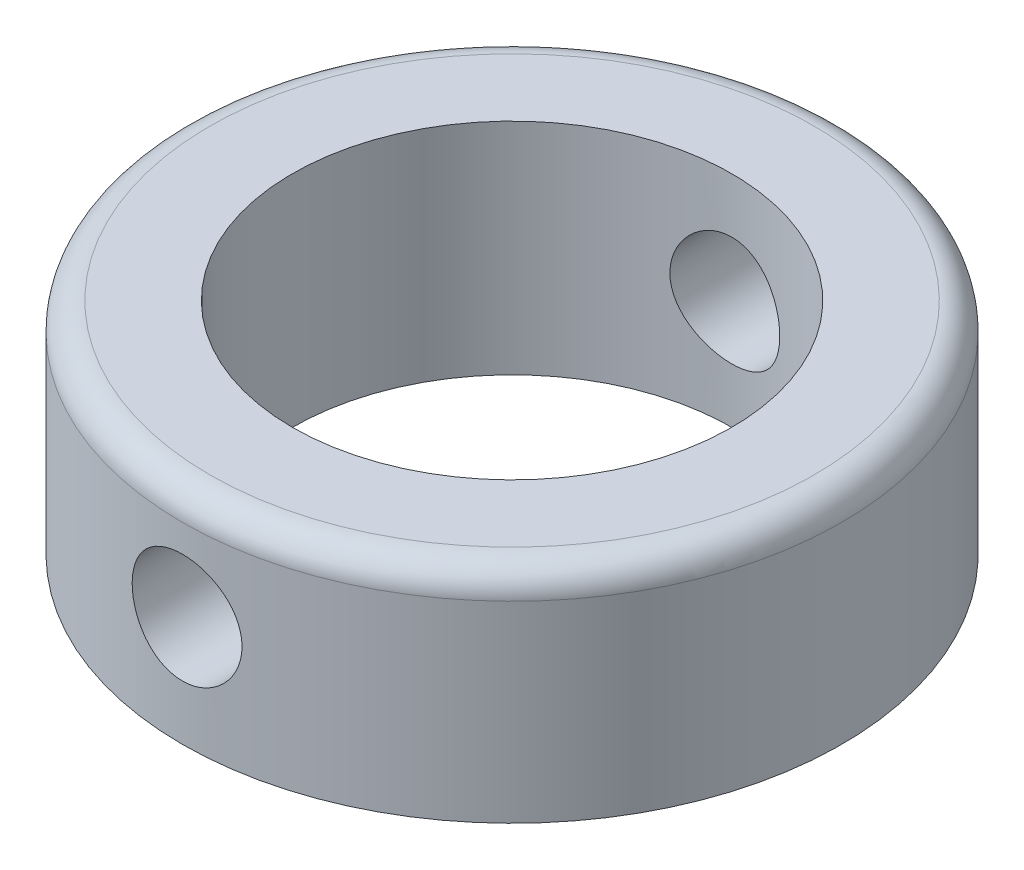
ISO-10303-21;
HEADER;
FILE_DESCRIPTION(('STEP AP214'),'2;1');
FILE_NAME('part.step','',(''),(''),'','','');
FILE_SCHEMA(('AUTOMOTIVE_DESIGN { 1 0 10303 214 1 1 1 1 }'));
ENDSEC;
DATA;
#1=APPLICATION_CONTEXT('core data for automotive mechanical design processes');
#2=APPLICATION_PROTOCOL_DEFINITION('international standard','automotive_design',2000,#1);
#3=PRODUCT_CONTEXT('',#1,'mechanical');
#4=PRODUCT('Part','Part','',(#3));
#5=PRODUCT_RELATED_PRODUCT_CATEGORY('part','',(#4));
#6=PRODUCT_DEFINITION_FORMATION('','',#4);
#7=PRODUCT_DEFINITION_CONTEXT('part definition',#1,'design');
#8=PRODUCT_DEFINITION('design','',#6,#7);
#9=PRODUCT_DEFINITION_SHAPE('','',#8);
#10=(LENGTH_UNIT() NAMED_UNIT(*) SI_UNIT(.MILLI.,.METRE.));
#11=(NAMED_UNIT(*) PLANE_ANGLE_UNIT() SI_UNIT($,.RADIAN.));
#12=(NAMED_UNIT(*) SI_UNIT($,.STERADIAN.) SOLID_ANGLE_UNIT());
#13=UNCERTAINTY_MEASURE_WITH_UNIT(LENGTH_MEASURE(1.E-05),#10,'distance_accuracy_value','');
#14=(GEOMETRIC_REPRESENTATION_CONTEXT(3) GLOBAL_UNCERTAINTY_ASSIGNED_CONTEXT((#13)) GLOBAL_UNIT_ASSIGNED_CONTEXT((#10,
#11,#12)) REPRESENTATION_CONTEXT('',''));
#15=CARTESIAN_POINT('',(0.,0.,0.));
#16=DIRECTION('',(0.,0.,1.));
#17=DIRECTION('',(1.,0.,0.));
#18=AXIS2_PLACEMENT_3D('',#15,#16,#17);
#19=CARTESIAN_POINT('',(0.,4.,0.));
#20=DIRECTION('',(0.,1.,0.));
#21=DIRECTION('',(0.,0.,1.));
#22=AXIS2_PLACEMENT_3D('',#19,#20,#21);
#23=PLANE('',#22);
#24=CARTESIAN_POINT('',(0.,4.,0.));
#25=DIRECTION('',(0.,1.,0.));
#26=DIRECTION('',(0.,0.,1.));
#27=AXIS2_PLACEMENT_3D('',#24,#25,#26);
#28=CIRCLE('',#27,11.);
#29=CARTESIAN_POINT('',(0.,4.,11.));
#30=VERTEX_POINT('',#29);
#31=EDGE_CURVE('E43',#30,#30,#28,.T.);
#32=ORIENTED_EDGE('',*,*,#31,.T.);
#33=EDGE_LOOP('',(#32));
#34=FACE_BOUND('',#33,.T.);
#35=CARTESIAN_POINT('',(0.,4.,0.));
#36=DIRECTION('',(0.,1.,0.));
#37=DIRECTION('',(0.,0.,1.));
#38=AXIS2_PLACEMENT_3D('',#35,#36,#37);
#39=CIRCLE('',#38,8.);
#40=CARTESIAN_POINT('',(0.,4.,8.));
#41=VERTEX_POINT('',#40);
#42=EDGE_CURVE('E96',#41,#41,#39,.T.);
#43=ORIENTED_EDGE('',*,*,#42,.F.);
#44=EDGE_LOOP('',(#43));
#45=FACE_BOUND('',#44,.T.);
#46=ADVANCED_FACE('F30',(#34,#45),#23,.T.);
#47=CARTESIAN_POINT('',(0.,-4.,0.));
#48=DIRECTION('',(0.,1.,0.));
#49=DIRECTION('',(0.,0.,1.));
#50=AXIS2_PLACEMENT_3D('',#47,#48,#49);
#51=PLANE('',#50);
#52=CARTESIAN_POINT('',(0.,-4.,0.));
#53=DIRECTION('',(0.,1.,0.));
#54=DIRECTION('',(0.,0.,1.));
#55=AXIS2_PLACEMENT_3D('',#52,#53,#54);
#56=CIRCLE('',#55,12.);
#57=CARTESIAN_POINT('',(0.,-4.,12.));
#58=VERTEX_POINT('',#57);
#59=EDGE_CURVE('E48',#58,#58,#56,.T.);
#60=ORIENTED_EDGE('',*,*,#59,.F.);
#61=EDGE_LOOP('',(#60));
#62=FACE_BOUND('',#61,.T.);
#63=CARTESIAN_POINT('',(0.,-4.,0.));
#64=DIRECTION('',(0.,1.,0.));
#65=DIRECTION('',(0.,0.,1.));
#66=AXIS2_PLACEMENT_3D('',#63,#64,#65);
#67=CIRCLE('',#66,8.);
#68=CARTESIAN_POINT('',(0.,-4.,8.));
#69=VERTEX_POINT('',#68);
#70=EDGE_CURVE('E98',#69,#69,#67,.T.);
#71=ORIENTED_EDGE('',*,*,#70,.T.);
#72=EDGE_LOOP('',(#71));
#73=FACE_BOUND('',#72,.T.);
#74=ADVANCED_FACE('F83',(#62,#73),#51,.F.);
#75=CARTESIAN_POINT('',(0.,4.,0.));
#76=DIRECTION('',(0.,-1.,0.));
#77=DIRECTION('',(0.,0.,-1.));
#78=AXIS2_PLACEMENT_3D('',#75,#76,#77);
#79=CYLINDRICAL_SURFACE('',#78,12.);
#80=CARTESIAN_POINT('',(0.,2.,-12.));
#81=CARTESIAN_POINT('',(-0.111512723966572,1.99999552884175,-11.9999980893506));
#82=CARTESIAN_POINT('',(-0.223086305471057,1.99064218002486,-11.9984294233043));
#83=CARTESIAN_POINT('',(-0.443104177338434,1.95349147298774,-11.9923227595311));
#84=CARTESIAN_POINT('',(-0.551545494367397,1.92567715447072,-11.9877820313911));
#85=CARTESIAN_POINT('',(-0.762083797770115,1.8524676411258,-11.9762405458916));
#86=CARTESIAN_POINT('',(-0.864185894745521,1.80708682748754,-11.9692418012735));
#87=CARTESIAN_POINT('',(-1.05931347358236,1.70007016635808,-11.9535538166566));
#88=CARTESIAN_POINT('',(-1.15233999190287,1.6384361780136,-11.9448647700355));
#89=CARTESIAN_POINT('',(-1.32757809143334,1.50003593294363,-11.9266665396665));
#90=CARTESIAN_POINT('',(-1.40969032282797,1.4231447082911,-11.9171509745189));
#91=CARTESIAN_POINT('',(-1.55991079892794,1.25668162522175,-11.8984210150139));
#92=CARTESIAN_POINT('',(-1.62801815951278,1.16710896683471,-11.8892066397013));
#93=CARTESIAN_POINT('',(-1.74869370048411,0.977143227042356,-11.8720605260782));
#94=CARTESIAN_POINT('',(-1.8011636422888,0.876686930556196,-11.8641370327331));
#95=CARTESIAN_POINT('',(-1.88844669232898,0.668232348559499,-11.8505583183574));
#96=CARTESIAN_POINT('',(-1.92326099325249,0.560234573057895,-11.8449029441145));
#97=CARTESIAN_POINT('',(-1.97393150222785,0.340815780114768,-11.836564294742));
#98=CARTESIAN_POINT('',(-1.98995922330832,0.229435410798886,-11.8338541478856));
#99=CARTESIAN_POINT('',(-2.0031333802319,0.00553577849322256,-11.8316315114932));
#100=CARTESIAN_POINT('',(-2.0002811523112,-0.10698340333384,-11.8321187956577));
#101=CARTESIAN_POINT('',(-1.97591607871692,-0.328742289020359,-11.8362114309084));
#102=CARTESIAN_POINT('',(-1.95459590551182,-0.438003842836187,-11.8397845865513));
#103=CARTESIAN_POINT('',(-1.89420251232276,-0.651377054263307,-11.8495959616881));
#104=CARTESIAN_POINT('',(-1.85512868345579,-0.755488535110837,-11.8558342725862));
#105=CARTESIAN_POINT('',(-1.76014179687513,-0.956183058752736,-11.8703078346728));
#106=CARTESIAN_POINT('',(-1.70414873110377,-1.05272752486498,-11.8785525368586));
#107=CARTESIAN_POINT('',(-1.57696961404595,-1.23512352043071,-11.8961033473201));
#108=CARTESIAN_POINT('',(-1.50578233652343,-1.32097418596395,-11.9054095412343));
#109=CARTESIAN_POINT('',(-1.34918576972724,-1.48066086864588,-11.9241762230383));
#110=CARTESIAN_POINT('',(-1.2636111710985,-1.55433481483207,-11.9336371938532));
#111=CARTESIAN_POINT('',(-1.08122819918532,-1.68630221013227,-11.9515408111738));
#112=CARTESIAN_POINT('',(-0.984419753525137,-1.74459556014658,-11.959983451118));
#113=CARTESIAN_POINT('',(-0.782164732933368,-1.84416178170903,-11.9749111431433));
#114=CARTESIAN_POINT('',(-0.676710980451728,-1.88542033546501,-11.9813945472596));
#115=CARTESIAN_POINT('',(-0.460238676482184,-1.94959537219678,-11.9916600241013));
#116=CARTESIAN_POINT('',(-0.349220591343574,-1.97251338957897,-11.9954423228038));
#117=CARTESIAN_POINT('',(-0.126167921041298,-1.99913708676891,-11.9998490387415));
#118=CARTESIAN_POINT('',(-0.0141605897208081,-2.00306525744449,-12.0005100241023));
#119=CARTESIAN_POINT('',(0.208911818311911,-1.9921909244575,-11.9986997953694));
#120=CARTESIAN_POINT('',(0.319976931113632,-1.97738914149301,-11.9962287017929));
#121=CARTESIAN_POINT('',(0.537324940437412,-1.92966012053162,-11.9884546155056));
#122=CARTESIAN_POINT('',(0.643632694708304,-1.8968430332879,-11.9831688384105));
#123=CARTESIAN_POINT('',(0.849237507888355,-1.81413238544037,-11.9703557156429));
#124=CARTESIAN_POINT('',(0.948534172727776,-1.76423786589178,-11.9628282440962));
#125=CARTESIAN_POINT('',(1.13826455157517,-1.64827910024257,-11.9462761304193));
#126=CARTESIAN_POINT('',(1.22861220074972,-1.5820758750662,-11.9372388470962));
#127=CARTESIAN_POINT('',(1.39699486840215,-1.43557014769195,-11.9187077391352));
#128=CARTESIAN_POINT('',(1.47502899175727,-1.35526662137866,-11.9092138813724));
#129=CARTESIAN_POINT('',(1.6173942237264,-1.18184196154286,-11.8907214018868));
#130=CARTESIAN_POINT('',(1.68157500889097,-1.08859666758847,-11.8817289290968));
#131=CARTESIAN_POINT('',(1.79336184823599,-0.892517624689169,-11.8653722382231));
#132=CARTESIAN_POINT('',(1.84096842781586,-0.789684179818004,-11.8580079685282));
#133=CARTESIAN_POINT('',(1.91803066517852,-0.577768213750294,-11.8457876295816));
#134=CARTESIAN_POINT('',(1.94756114603836,-0.468713523975608,-11.8409212344885));
#135=CARTESIAN_POINT('',(1.98786836302262,-0.24710389662259,-11.8342217346821));
#136=CARTESIAN_POINT('',(1.99864672955693,-0.134549264214358,-11.8323883662618));
#137=CARTESIAN_POINT('',(2.00109829283788,0.0893641327699283,-11.8319738646721));
#138=CARTESIAN_POINT('',(1.99300810890015,0.200720302860232,-11.8333524520452));
#139=CARTESIAN_POINT('',(1.95846387116548,0.420463398440613,-11.8391182516298));
#140=CARTESIAN_POINT('',(1.93200987688998,0.528850333553498,-11.8435054540897));
#141=CARTESIAN_POINT('',(1.86157959167592,0.739486749834092,-11.8547788502538));
#142=CARTESIAN_POINT('',(1.81762367248035,0.84174320804482,-11.8616621377574));
#143=CARTESIAN_POINT('',(1.71346160313273,1.03746853535588,-11.8771549513777));
#144=CARTESIAN_POINT('',(1.65325464699885,1.13093696829771,-11.8857645631072));
#145=CARTESIAN_POINT('',(1.51745510749772,1.3076284664862,-11.903867632365));
#146=CARTESIAN_POINT('',(1.44168845087492,1.39071681336022,-11.9133703646104));
#147=CARTESIAN_POINT('',(1.27728722510418,1.54308128357995,-11.9321149788867));
#148=CARTESIAN_POINT('',(1.18864969033011,1.61235421491054,-11.9413568002124));
#149=CARTESIAN_POINT('',(1.00029533571222,1.73555861455996,-11.9586122371378));
#150=CARTESIAN_POINT('',(0.900506230026254,1.78938083145036,-11.9666169300248));
#151=CARTESIAN_POINT('',(0.693210455503184,1.87941558768794,-11.9804093408142));
#152=CARTESIAN_POINT('',(0.585711595864007,1.91564566486376,-11.9861992654199));
#153=CARTESIAN_POINT('',(0.39816264803632,1.96160421930133,-11.9936463266636));
#154=CARTESIAN_POINT('',(0.319247064238757,1.97597957569277,-11.9960162181869));
#155=CARTESIAN_POINT('',(0.160231448255847,1.9951789902758,-11.999193727889));
#156=CARTESIAN_POINT('',(0.0801314364867952,2.00000321290989,-12.0000013729651));
#157=CARTESIAN_POINT('',(0.,2.,-12.));
#158=B_SPLINE_CURVE_WITH_KNOTS('',3,(#80,#81,#82,#83,#84,#85,#86,#87,#88,#89,#90,#91,#92,#93,
#94,#95,#96,#97,#98,#99,#100,#101,#102,#103,#104,#105,#106,#107,#108,#109,#110,#111,#112,#113,
#114,#115,#116,#117,#118,#119,#120,#121,#122,#123,#124,#125,#126,#127,#128,#129,#130,#131,#132,
#133,#134,#135,#136,#137,#138,#139,#140,#141,#142,#143,#144,#145,#146,#147,#148,#149,#150,#151,
#152,#153,#154,#155,#156,#157),.UNSPECIFIED.,.T.,.F.,(4,2,2,2,2,2,2,2,2,2,2,2,2,2,2,2,2,2,2,2,2,
2,2,2,2,2,2,2,2,2,2,2,2,2,2,2,2,2,4),(0.,0.334245267950808,0.668798036556336,1.00307749362022,
1.33731873013983,1.67441992849866,2.01154240135885,2.35074016659072,2.68991501500945,
3.02596861682739,3.36199843456709,3.69456417408327,4.02714132020305,4.36131645306046,
4.69551856544459,5.03386215929061,5.37220793308678,5.71083751132723,6.04943875616919,
6.38406306793118,6.71867450428688,7.05126245605132,7.38386908660853,7.71941460501619,
8.05498450443426,8.39403057606095,8.73306589900754,9.07068817873417,9.40828110229294,
9.7416632761816,10.0750443695051,10.4080385458098,10.7410492402347,11.0780110735471,
11.4150506710318,11.7544178528576,12.0934460170406,12.3336339853121,12.5738178182157),.UNSPECIFIED.);
#159=CARTESIAN_POINT('',(0.,2.,-12.));
#160=VERTEX_POINT('',#159);
#161=EDGE_CURVE('E74',#160,#160,#158,.T.);
#162=ORIENTED_EDGE('',*,*,#161,.T.);
#163=EDGE_LOOP('',(#162));
#164=FACE_BOUND('',#163,.T.);
#165=CARTESIAN_POINT('',(2.,0.,11.8321595661992));
#166=CARTESIAN_POINT('',(1.99999551873586,-0.111500598529449,11.8321615789328));
#167=CARTESIAN_POINT('',(1.99064413522262,-0.223062084857178,11.8337527390819));
#168=CARTESIAN_POINT('',(1.9535019424531,-0.443054834610535,11.8399396576003));
#169=CARTESIAN_POINT('',(1.92569412824689,-0.551483115006452,11.844538186771));
#170=CARTESIAN_POINT('',(1.8525036349364,-0.761993826673285,11.8562048749385));
#171=CARTESIAN_POINT('',(1.80713564394559,-0.864081478929797,11.8632709694721));
#172=CARTESIAN_POINT('',(1.70014919751157,-1.05918476377422,11.8790741768183));
#173=CARTESIAN_POINT('',(1.63853257080106,-1.15220141566187,11.8878111015538));
#174=CARTESIAN_POINT('',(1.50015002157323,-1.32745027979565,11.906067769247));
#175=CARTESIAN_POINT('',(1.42325523914587,-1.40958010510897,11.9155937386236));
#176=CARTESIAN_POINT('',(1.25677760375622,-1.55983464548945,11.9342998453486));
#177=CARTESIAN_POINT('',(1.16719399931998,-1.62795853049233,11.9434799621739));
#178=CARTESIAN_POINT('',(0.977218295958685,-1.74865165377542,11.9605258958617));
#179=CARTESIAN_POINT('',(0.876764865165367,-1.80112560618544,11.9683835394587));
#180=CARTESIAN_POINT('',(0.668316497379094,-1.88841685642444,11.9818298956567));
#181=CARTESIAN_POINT('',(0.56032205126255,-1.9232353023079,11.9874187557813));
#182=CARTESIAN_POINT('',(0.340914981075393,-1.97391402798712,11.9956538777952));
#183=CARTESIAN_POINT('',(0.229543109343416,-1.98994633280375,11.9983268248873));
#184=CARTESIAN_POINT('',(0.00566022842063735,-2.00313260332208,12.0005206347422));
#185=CARTESIAN_POINT('',(-0.106850702823119,-2.00028785219779,12.0000417117545));
#186=CARTESIAN_POINT('',(-0.328641748063101,-1.97593491877743,11.9960068674511));
#187=CARTESIAN_POINT('',(-0.437942824560113,-1.95461186927268,11.9924814695392));
#188=CARTESIAN_POINT('',(-0.651393583689433,-1.89419914060281,11.9827838301731));
#189=CARTESIAN_POINT('',(-0.755543109321203,-1.8551089203284,11.9766115081057));
#190=CARTESIAN_POINT('',(-0.956284918226118,-1.76008748774774,11.9622615880957));
#191=CARTESIAN_POINT('',(-1.05284041841524,-1.70407999033405,11.954074938615));
#192=CARTESIAN_POINT('',(-1.23525242387731,-1.57686974189196,11.936605904572));
#193=CARTESIAN_POINT('',(-1.3211080623327,-1.50566576103135,11.9273234313531));
#194=CARTESIAN_POINT('',(-1.48077701875733,-1.34905695470455,11.9085621458608));
#195=CARTESIAN_POINT('',(-1.55443160180257,-1.26349032407921,11.8990823178483));
#196=CARTESIAN_POINT('',(-1.68636367075845,-1.08113032782734,11.8811036782784));
#197=CARTESIAN_POINT('',(-1.74464101482593,-0.984336858653744,11.8726048757706));
#198=CARTESIAN_POINT('',(-1.84419554759063,-0.782086686498016,11.8575500364945));
#199=CARTESIAN_POINT('',(-1.88545362182339,-0.676620401526327,11.8509961864208));
#200=CARTESIAN_POINT('',(-1.94962389665249,-0.460120742153965,11.840609509519));
#201=CARTESIAN_POINT('',(-1.97253771261436,-0.349087858854061,11.8367764431066));
#202=CARTESIAN_POINT('',(-1.99914550790341,-0.126027075070295,11.8323116753769));
#203=CARTESIAN_POINT('',(-2.00306576632995,-0.0140268962383188,11.8316422860694));
#204=CARTESIAN_POINT('',(-1.99217816214597,0.209029337352656,11.8334802782589));
#205=CARTESIAN_POINT('',(-1.97737102289973,0.320085428411178,11.8359875370548));
#206=CARTESIAN_POINT('',(-1.92964186794248,0.537382207352687,11.8438614996401));
#207=CARTESIAN_POINT('',(-1.89683503251711,0.643648911902409,11.8492100153468));
#208=CARTESIAN_POINT('',(-1.81415855215382,0.849176133023589,11.862148584044));
#209=CARTESIAN_POINT('',(-1.76428788648075,0.948436230040721,11.8697387711246));
#210=CARTESIAN_POINT('',(-1.64836533858338,1.13813967552489,11.8863930271791));
#211=CARTESIAN_POINT('',(-1.58216845132749,1.22849325820485,11.8954700448028));
#212=CARTESIAN_POINT('',(-1.43567157256638,1.396890826156,11.9140373334389));
#213=CARTESIAN_POINT('',(-1.35537058910724,1.47493394488779,11.9235276334827));
#214=CARTESIAN_POINT('',(-1.18194245626305,1.61732151418296,11.9419713769461));
#215=CARTESIAN_POINT('',(-1.08869060270896,1.68151506102763,11.9509182107574));
#216=CARTESIAN_POINT('',(-0.89259475835946,1.7933242616039,11.9671608994635));
#217=CARTESIAN_POINT('',(-0.789751077976501,1.84094045157908,11.9744568077598));
#218=CARTESIAN_POINT('',(-0.577839241201063,1.91800846716389,11.9865468653567));
#219=CARTESIAN_POINT('',(-0.468800450082089,1.94753926058794,11.9913518765409));
#220=CARTESIAN_POINT('',(-0.247224587899369,1.98785247917106,11.9979646653543));
#221=CARTESIAN_POINT('',(-0.134687805457296,1.99863644698588,11.9997726896015));
#222=CARTESIAN_POINT('',(0.0892330206189413,2.00110550584976,12.0001843031025));
#223=CARTESIAN_POINT('',(0.200614528482132,1.99302020315287,11.9988264161935));
#224=CARTESIAN_POINT('',(0.420409579451764,1.95847686218446,11.9931374270987));
#225=CARTESIAN_POINT('',(0.528823139173983,1.93201892679226,11.9888063415615));
#226=CARTESIAN_POINT('',(0.73951715673483,1.86156946756508,11.9776559106192));
#227=CARTESIAN_POINT('',(0.841804297723056,1.81759746543196,11.970839336327));
#228=CARTESIAN_POINT('',(1.03758436238573,1.71339365101553,11.9554620550242));
#229=CARTESIAN_POINT('',(1.13107686889458,1.65316106795004,11.9469012653393));
#230=CARTESIAN_POINT('',(1.30777035642112,1.5173319260316,11.9288610369313));
#231=CARTESIAN_POINT('',(1.3908411444822,1.441567236199,11.919372196329));
#232=CARTESIAN_POINT('',(1.54317110076073,1.27717735367695,11.900610426515));
#233=CARTESIAN_POINT('',(1.61242702936952,1.18854915286998,11.8913375483961));
#234=CARTESIAN_POINT('',(1.73561141672869,1.00020374200831,11.8739867482713));
#235=CARTESIAN_POINT('',(1.78942799124616,0.900412528187612,11.8659177427663));
#236=CARTESIAN_POINT('',(1.87945162912342,0.693112611329484,11.8519936807305));
#237=CARTESIAN_POINT('',(1.91567628417846,0.585611741858109,11.846136413799));
#238=CARTESIAN_POINT('',(1.96162084250194,0.398076984410093,11.8385979588519));
#239=CARTESIAN_POINT('',(1.97598993413711,0.319178553629914,11.8361969873557));
#240=CARTESIAN_POINT('',(1.99518103614505,0.16019721213045,11.8329770823046));
#241=CARTESIAN_POINT('',(2.00000321983422,0.0801143229406407,11.8321581200295));
#242=CARTESIAN_POINT('',(2.,0.,11.8321595661992));
#243=B_SPLINE_CURVE_WITH_KNOTS('',3,(#165,#166,#167,#168,#169,#170,#171,#172,#173,#174,#175,
#176,#177,#178,#179,#180,#181,#182,#183,#184,#185,#186,#187,#188,#189,#190,#191,#192,#193,#194,
#195,#196,#197,#198,#199,#200,#201,#202,#203,#204,#205,#206,#207,#208,#209,#210,#211,#212,#213,
#214,#215,#216,#217,#218,#219,#220,#221,#222,#223,#224,#225,#226,#227,#228,#229,#230,#231,#232,
#233,#234,#235,#236,#237,#238,#239,#240,#241,#242),.UNSPECIFIED.,.T.,.F.,(4,2,2,2,2,2,2,2,2,2,2,
2,2,2,2,2,2,2,2,2,2,2,2,2,2,2,2,2,2,2,2,2,2,2,2,2,2,2,4),(0.,0.334208831142192,
0.668726015970376,1.00296399830015,1.33716437924219,1.67431327324572,2.01148214267558,
2.35066384089148,2.6898234808889,3.02585253978052,3.36185875722154,3.69453696931735,
4.02722531399626,4.3614368331154,4.69567540981411,5.03396898769699,5.37226568596815,
5.71094129998883,6.04958708750462,6.38418833936328,6.71877666731181,7.05124851708393,
7.38374025834859,7.71929874210162,8.05488083544551,8.39395290428305,8.73301400381358,
9.07058387534117,9.40812596729881,9.74158221012733,10.0750365857506,10.4081203186597,
10.7412198431387,11.078135979706,11.4151310310545,11.7545098209466,12.0935485339556,
12.3336853643501,12.5738178352145),.UNSPECIFIED.);
#244=CARTESIAN_POINT('',(2.,0.,11.8321595661992));
#245=VERTEX_POINT('',#244);
#246=EDGE_CURVE('E69',#245,#245,#243,.T.);
#247=ORIENTED_EDGE('',*,*,#246,.T.);
#248=EDGE_LOOP('',(#247));
#249=FACE_BOUND('',#248,.T.);
#250=CARTESIAN_POINT('',(0.,3.,0.));
#251=DIRECTION('',(0.,1.,0.));
#252=DIRECTION('',(0.,0.,1.));
#253=AXIS2_PLACEMENT_3D('',#250,#251,#252);
#254=CIRCLE('',#253,12.);
#255=CARTESIAN_POINT('',(0.,3.,12.));
#256=VERTEX_POINT('',#255);
#257=EDGE_CURVE('E10',#256,#256,#254,.F.);
#258=ORIENTED_EDGE('',*,*,#257,.T.);
#259=EDGE_LOOP('',(#258));
#260=FACE_BOUND('',#259,.T.);
#261=ORIENTED_EDGE('',*,*,#59,.T.);
#262=EDGE_LOOP('',(#261));
#263=FACE_BOUND('',#262,.T.);
#264=ADVANCED_FACE('F79',(#164,#249,#260,#263),#79,.T.);
#265=CARTESIAN_POINT('',(0.,4.,0.));
#266=DIRECTION('',(0.,-1.,0.));
#267=DIRECTION('',(0.,0.,-1.));
#268=AXIS2_PLACEMENT_3D('',#265,#266,#267);
#269=CYLINDRICAL_SURFACE('',#268,8.);
#270=CARTESIAN_POINT('',(0.,2.,-8.));
#271=CARTESIAN_POINT('',(-0.110501451559641,1.99999689901579,-7.9999981315735));
#272=CARTESIAN_POINT('',(-0.221037543774351,1.99081126563495,-7.99768770842435));
#273=CARTESIAN_POINT('',(-0.438941765027377,1.95436646492399,-7.98869485106526));
#274=CARTESIAN_POINT('',(-0.546308062494319,1.92709705394953,-7.98200993893301));
#275=CARTESIAN_POINT('',(-0.754694496243436,1.85541432871722,-7.96500835109376));
#276=CARTESIAN_POINT('',(-0.855722084573336,1.81102160171297,-7.95469603789411));
#277=CARTESIAN_POINT('',(-1.04889617587257,1.70642481327354,-7.93153791743495));
#278=CARTESIAN_POINT('',(-1.14104237913168,1.64622021850804,-7.91869202472209));
#279=CARTESIAN_POINT('',(-1.31573590306789,1.51039894712776,-7.89156551455591));
#280=CARTESIAN_POINT('',(-1.39807425341474,1.43451790005459,-7.87726276197502));
#281=CARTESIAN_POINT('',(-1.54899856960443,1.27006372678795,-7.84898160157248));
#282=CARTESIAN_POINT('',(-1.61758298259892,1.18148916940409,-7.83500323053157));
#283=CARTESIAN_POINT('',(-1.74003539039863,0.992539697684012,-7.80873034264225));
#284=CARTESIAN_POINT('',(-1.79366962123352,0.892009025588362,-7.79646392619748));
#285=CARTESIAN_POINT('',(-1.88319587806766,0.68300211778662,-7.77532659757355));
#286=CARTESIAN_POINT('',(-1.91909074058685,0.574527155557313,-7.76645514259225));
#287=CARTESIAN_POINT('',(-1.97140644907302,0.355008669064454,-7.7533396892843));
#288=CARTESIAN_POINT('',(-1.98820302444274,0.244060138616011,-7.74900654662681));
#289=CARTESIAN_POINT('',(-2.00301570008854,0.020841908000873,-7.74519149946122));
#290=CARTESIAN_POINT('',(-2.00103485575748,-0.0914275742561825,-7.74570880570571));
#291=CARTESIAN_POINT('',(-1.97864869951961,-0.311221076993804,-7.75145607355756));
#292=CARTESIAN_POINT('',(-1.95869112025418,-0.418794161953773,-7.75657150676391));
#293=CARTESIAN_POINT('',(-1.90163224920399,-0.629014734548078,-7.77075612894758));
#294=CARTESIAN_POINT('',(-1.86452973609252,-0.731661870705228,-7.77982559958985));
#295=CARTESIAN_POINT('',(-1.77385263724958,-0.930317355002839,-7.80100151874212));
#296=CARTESIAN_POINT('',(-1.72011555631056,-1.02624822905276,-7.81313769959755));
#297=CARTESIAN_POINT('',(-1.59780836801993,-1.20789161300909,-7.83906281127988));
#298=CARTESIAN_POINT('',(-1.52923566507845,-1.29360233075633,-7.85285203112837));
#299=CARTESIAN_POINT('',(-1.37688456624163,-1.45493815425921,-7.88101174053188));
#300=CARTESIAN_POINT('',(-1.29272834422115,-1.53020598674847,-7.89538759304001));
#301=CARTESIAN_POINT('',(-1.11281589000493,-1.6656283232852,-7.92274620771675));
#302=CARTESIAN_POINT('',(-1.01705930361059,-1.72578236568475,-7.93572892732543));
#303=CARTESIAN_POINT('',(-0.816154518241856,-1.82940078163251,-7.9589030945892));
#304=CARTESIAN_POINT('',(-0.710975190944831,-1.87280712033924,-7.96908480170303));
#305=CARTESIAN_POINT('',(-0.49450134419051,-1.94122307427943,-7.98543889321888));
#306=CARTESIAN_POINT('',(-0.383207998867313,-1.96623620855752,-7.99161204452374));
#307=CARTESIAN_POINT('',(-0.160719960520036,-1.99661008741178,-7.999139990285));
#308=CARTESIAN_POINT('',(-0.0495956266509464,-2.0024573681004,-8.00061404677705));
#309=CARTESIAN_POINT('',(0.172043833068677,-1.99566799725935,-7.99891739752601));
#310=CARTESIAN_POINT('',(0.28255901285946,-1.98303300960116,-7.99574710989128));
#311=CARTESIAN_POINT('',(0.498152358368655,-1.94003878881149,-7.98519441503143));
#312=CARTESIAN_POINT('',(0.603286825291672,-1.90994498203068,-7.97787512247748));
#313=CARTESIAN_POINT('',(0.807009723270014,-1.83319055462874,-7.95984942178845));
#314=CARTESIAN_POINT('',(0.905597492043512,-1.78652826091577,-7.94914267159856));
#315=CARTESIAN_POINT('',(1.0953641792398,-1.6770184948337,-7.92524410568414));
#316=CARTESIAN_POINT('',(1.18638058911444,-1.61389851680432,-7.91201156489243));
#317=CARTESIAN_POINT('',(1.35670215152433,-1.47361345493737,-7.88459345583226));
#318=CARTESIAN_POINT('',(1.43600527863068,-1.39644594717746,-7.87040772335606));
#319=CARTESIAN_POINT('',(1.58265409076364,-1.22799738554071,-7.84225275947695));
#320=CARTESIAN_POINT('',(1.64965849016271,-1.13641639599677,-7.82829738916375));
#321=CARTESIAN_POINT('',(1.7673476786836,-0.943023154045712,-7.80257171169652));
#322=CARTESIAN_POINT('',(1.81803319221058,-0.841211356053663,-7.79080130756035));
#323=CARTESIAN_POINT('',(1.90126856081239,-0.630792370115896,-7.77090792979554));
#324=CARTESIAN_POINT('',(1.93392586220542,-0.522229828874655,-7.76276340389207));
#325=CARTESIAN_POINT('',(1.98046087993837,-0.300920482814523,-7.75102325453578));
#326=CARTESIAN_POINT('',(1.99434270330488,-0.188174598623346,-7.74742663626581));
#327=CARTESIAN_POINT('',(2.00271812044533,0.0348280318069368,-7.74526534938609));
#328=CARTESIAN_POINT('',(1.99775719704016,0.145063246832974,-7.74655910304351));
#329=CARTESIAN_POINT('',(1.96983637108382,0.363071851557308,-7.7537054534379));
#330=CARTESIAN_POINT('',(1.94687683024903,0.470845290684867,-7.75955795855809));
#331=CARTESIAN_POINT('',(1.88390842592373,0.680277945420544,-7.77508347576963));
#332=CARTESIAN_POINT('',(1.84400187290717,0.781969740320277,-7.78473353648412));
#333=CARTESIAN_POINT('',(1.74835321814009,0.977287176951585,-7.80677007633105));
#334=CARTESIAN_POINT('',(1.69260892004558,1.07091169758255,-7.81915693494364));
#335=CARTESIAN_POINT('',(1.56515699818285,1.25007283866936,-7.8456751235135));
#336=CARTESIAN_POINT('',(1.49307088388301,1.33533476456528,-7.85984353109009));
#337=CARTESIAN_POINT('',(1.33571916158631,1.49272939306054,-7.88810702995048));
#338=CARTESIAN_POINT('',(1.25045042834819,1.56485897348396,-7.90220210302746));
#339=CARTESIAN_POINT('',(1.06729011560345,1.69521507808614,-7.92903540863551));
#340=CARTESIAN_POINT('',(0.969197896421849,1.75316615156211,-7.94174444487824));
#341=CARTESIAN_POINT('',(0.764354746013968,1.85166328392071,-7.96406566633491));
#342=CARTESIAN_POINT('',(0.65761008458232,1.89222181419805,-7.97368006933042));
#343=CARTESIAN_POINT('',(0.459213670991296,1.94876244043954,-7.98730746087389));
#344=CARTESIAN_POINT('',(0.368506894544092,1.96793499073791,-7.9920344673692));
#345=CARTESIAN_POINT('',(0.185208095381712,1.99355459149592,-7.99838140309264));
#346=CARTESIAN_POINT('',(0.0926162149901554,2.00000259907373,-8.00000156601192));
#347=CARTESIAN_POINT('',(0.,2.,-8.));
#348=B_SPLINE_CURVE_WITH_KNOTS('',3,(#270,#271,#272,#273,#274,#275,#276,#277,#278,#279,#280,
#281,#282,#283,#284,#285,#286,#287,#288,#289,#290,#291,#292,#293,#294,#295,#296,#297,#298,#299,
#300,#301,#302,#303,#304,#305,#306,#307,#308,#309,#310,#311,#312,#313,#314,#315,#316,#317,#318,
#319,#320,#321,#322,#323,#324,#325,#326,#327,#328,#329,#330,#331,#332,#333,#334,#335,#336,#337,
#338,#339,#340,#341,#342,#343,#344,#345,#346,#347),.UNSPECIFIED.,.T.,.F.,(4,2,2,2,2,2,2,2,2,2,2,
2,2,2,2,2,2,2,2,2,2,2,2,2,2,2,2,2,2,2,2,2,2,2,2,2,2,2,4),(0.,0.33116494996252,0.662517650351866,
0.993473203048141,1.32443992022577,1.66152580582852,1.99864972773416,2.34078196727742,
2.68285948225824,3.01808393468093,3.3532538415469,3.68029996013785,4.00736937959145,
4.337740371696,4.66816921119311,5.00802001296453,5.34788119415424,5.6889097201658,
6.02987298255951,6.36211078603463,6.69431868154751,7.02160366023144,7.34892169767481,
7.68204783424897,8.01523150681786,8.35659345610395,8.69794025003772,9.03723006156476,
9.37644564340971,9.70591707202578,10.0353818794581,10.3628853408369,10.6904342418696,
11.0265276855097,11.3627009303165,11.7049624733721,12.0469781843289,12.3245632392729,
12.6021274139515),.UNSPECIFIED.);
#349=CARTESIAN_POINT('',(0.,2.,-8.));
#350=VERTEX_POINT('',#349);
#351=EDGE_CURVE('E34',#350,#350,#348,.T.);
#352=ORIENTED_EDGE('',*,*,#351,.F.);
#353=EDGE_LOOP('',(#352));
#354=FACE_BOUND('',#353,.T.);
#355=CARTESIAN_POINT('',(2.,0.,7.74596669241483));
#356=CARTESIAN_POINT('',(1.99999686287446,-0.110440600741261,7.74596880070288));
#357=CARTESIAN_POINT('',(1.99082099639812,-0.220915918942817,7.74835444811678));
#358=CARTESIAN_POINT('',(1.95441850037103,-0.438694062538807,7.75761489594051));
#359=CARTESIAN_POINT('',(1.92718136539368,-0.545995003574548,7.76449230897304));
#360=CARTESIAN_POINT('',(1.85559295970563,-0.754242830549745,7.7819097967692));
#361=CARTESIAN_POINT('',(1.81126378228359,-0.855197724308566,7.79244514152366));
#362=CARTESIAN_POINT('',(1.70681691300911,-1.04824868203191,7.81598553623007));
#363=CARTESIAN_POINT('',(1.64669855084855,-1.14034436966417,7.82899069102791));
#364=CARTESIAN_POINT('',(1.51096674184951,-1.31508931620977,7.856325730845));
#365=CARTESIAN_POINT('',(1.43506951016324,-1.39751488028004,7.87067678098427));
#366=CARTESIAN_POINT('',(1.27054565128053,-1.54860911548827,7.89890300412235));
#367=CARTESIAN_POINT('',(1.18191783534425,-1.6172765004974,7.91277813253111));
#368=CARTESIAN_POINT('',(0.992916160863164,-1.73982037410502,7.93872332416466));
#369=CARTESIAN_POINT('',(0.892395660956096,-1.79347711052917,7.95076549920474));
#370=CARTESIAN_POINT('',(0.68341054743421,-1.88304771532247,7.97144649540787));
#371=CARTESIAN_POINT('',(0.574947108633552,-1.91896420153241,7.98008581867475));
#372=CARTESIAN_POINT('',(0.355487007003329,-1.97131826766287,7.99283807078544));
#373=CARTESIAN_POINT('',(0.244586175639181,-1.98813571546127,7.99703915075451));
#374=CARTESIAN_POINT('',(0.0214630554102159,-2.00300670342044,8.00074875285838));
#375=CARTESIAN_POINT('',(-0.0907590356304545,-2.00106301776768,8.00025796877363));
#376=CARTESIAN_POINT('',(-0.310704494344774,-1.97874011979988,7.99470475962828));
#377=CARTESIAN_POINT('',(-0.418472431202134,-1.95877093995692,7.98974401872699));
#378=CARTESIAN_POINT('',(-0.629076494827372,-1.9016229839612,7.97592669219883));
#379=CARTESIAN_POINT('',(-0.731912358740876,-1.86444329169807,7.96706989918753));
#380=CARTESIAN_POINT('',(-0.930813407003613,-1.77359794345035,7.94630007760717));
#381=CARTESIAN_POINT('',(-1.02680901953301,-1.7197863642706,7.93436015756043));
#382=CARTESIAN_POINT('',(-1.20855124468098,-1.59731545670699,7.90871923047719));
#383=CARTESIAN_POINT('',(-1.29429607017101,-1.5286535451515,7.89501791721992));
#384=CARTESIAN_POINT('',(-1.45554807016991,-1.3762330064141,7.86690971015616));
#385=CARTESIAN_POINT('',(-1.5307153581504,-1.29211608612178,7.85249375620734));
#386=CARTESIAN_POINT('',(-1.66595275192604,-1.1123200211678,7.82492034813365));
#387=CARTESIAN_POINT('',(-1.72602215209203,-1.0166403364072,7.81176295284776));
#388=CARTESIAN_POINT('',(-1.8295762580452,-0.815767972680828,7.78816397465319));
#389=CARTESIAN_POINT('',(-1.87297913394098,-0.710531415749445,7.77773586980577));
#390=CARTESIAN_POINT('',(-1.94137124127268,-0.493931625538839,7.76094912111966));
#391=CARTESIAN_POINT('',(-1.96636441310582,-0.382569708813491,7.75458960648175));
#392=CARTESIAN_POINT('',(-1.99666371093214,-0.160032398781503,7.74684284831313));
#393=CARTESIAN_POINT('',(-2.0024723791357,-0.0489297653362972,7.74532871274919));
#394=CARTESIAN_POINT('',(-1.99561359241244,0.172657549262526,7.74709874784831));
#395=CARTESIAN_POINT('',(-1.98294783827904,0.283142286360992,7.75038247681013));
#396=CARTESIAN_POINT('',(-1.93994037115013,0.498491411963765,7.76125665563648));
#397=CARTESIAN_POINT('',(-1.9098912546254,0.603418181256675,7.768775761875));
#398=CARTESIAN_POINT('',(-1.8332944653365,0.806745166281346,7.7872057461677));
#399=CARTESIAN_POINT('',(-1.78674483817004,0.905144607244272,7.79811702598891));
#400=CARTESIAN_POINT('',(-1.67741653434925,1.09475302229388,7.8223690967461));
#401=CARTESIAN_POINT('',(-1.6143374030685,1.18578307203448,7.83575334885313));
#402=CARTESIAN_POINT('',(-1.47412058586891,1.35615069024108,7.86333666457373));
#403=CARTESIAN_POINT('',(-1.39698058961088,1.43548633332006,7.87753586182776));
#404=CARTESIAN_POINT('',(-1.22852544196945,1.58224883405677,7.90557922425285));
#405=CARTESIAN_POINT('',(-1.13690390506319,1.64932805003905,7.91940561649468));
#406=CARTESIAN_POINT('',(-0.943405365389351,1.76714869356099,7.94477773290987));
#407=CARTESIAN_POINT('',(-0.841528897915182,1.81789097328656,7.95632357603169));
#408=CARTESIAN_POINT('',(-0.631116403462181,1.90115682762235,7.9757609259065));
#409=CARTESIAN_POINT('',(-0.522634762055764,1.93381142750325,7.98367864017925));
#410=CARTESIAN_POINT('',(-0.301499520637614,1.98036826768673,7.99508234716634));
#411=CARTESIAN_POINT('',(-0.188846730082481,1.99427412699123,7.99856919514738));
#412=CARTESIAN_POINT('',(0.034167052886647,2.00273517915108,8.00068338817612));
#413=CARTESIAN_POINT('',(0.144507653932044,1.99780341819082,7.99943957759977));
#414=CARTESIAN_POINT('',(0.362734992829503,1.9699043454113,7.99251792914887));
#415=CARTESIAN_POINT('',(0.470621803561858,1.94693756997366,7.98684022314338));
#416=CARTESIAN_POINT('',(0.680342071289548,1.88389556045828,7.97170865707778));
#417=CARTESIAN_POINT('',(0.782204989161726,1.84391309337124,7.96227529004785));
#418=CARTESIAN_POINT('',(0.977834106083248,1.74805884196086,7.94062577827316));
#419=CARTESIAN_POINT('',(1.07159928253127,1.69218505465903,7.92840928277515));
#420=CARTESIAN_POINT('',(1.25080385684661,1.56456953200773,7.90214499360574));
#421=CARTESIAN_POINT('',(1.33598997659667,1.49247971419234,7.88806033883329));
#422=CARTESIAN_POINT('',(1.49323004054701,1.33515429604531,7.85981298114379));
#423=CARTESIAN_POINT('',(1.56528065015318,1.24991536777767,7.84565025934604));
#424=CARTESIAN_POINT('',(1.69552405294366,1.06679717162108,7.81854951691005));
#425=CARTESIAN_POINT('',(1.75343323883276,0.968711753269491,7.80563927346578));
#426=CARTESIAN_POINT('',(1.85185379317094,0.76388902025036,7.78287910989656));
#427=CARTESIAN_POINT('',(1.8923778195043,0.657158067812306,7.77302696466427));
#428=CARTESIAN_POINT('',(1.94884505714201,0.458845976329679,7.75903817501475));
#429=CARTESIAN_POINT('',(1.96798634119376,0.368213671227727,7.75417326006998));
#430=CARTESIAN_POINT('',(1.99356458514354,0.185062262004624,7.7476367716524));
#431=CARTESIAN_POINT('',(2.0000026287435,0.0925433195111957,7.74596492578215));
#432=CARTESIAN_POINT('',(2.,0.,7.74596669241483));
#433=B_SPLINE_CURVE_WITH_KNOTS('',3,(#355,#356,#357,#358,#359,#360,#361,#362,#363,#364,#365,
#366,#367,#368,#369,#370,#371,#372,#373,#374,#375,#376,#377,#378,#379,#380,#381,#382,#383,#384,
#385,#386,#387,#388,#389,#390,#391,#392,#393,#394,#395,#396,#397,#398,#399,#400,#401,#402,#403,
#404,#405,#406,#407,#408,#409,#410,#411,#412,#413,#414,#415,#416,#417,#418,#419,#420,#421,#422,
#423,#424,#425,#426,#427,#428,#429,#430,#431,#432),.UNSPECIFIED.,.T.,.F.,(4,2,2,2,2,2,2,2,2,2,2,
2,2,2,2,2,2,2,2,2,2,2,2,2,2,2,2,2,2,2,2,2,2,2,2,2,2,2,4),(0.,0.330981953388909,
0.662156593142933,0.992904581732816,1.32366661404383,1.66099163354381,1.99834817183893,
2.34041197118336,2.68242527877674,3.01751000796277,3.35254518932816,3.68014610151158,
4.00776445379829,4.33834299403556,4.66897908375131,5.00856373257529,5.34816424959842,
5.68941145606722,6.03058560103638,6.36274859809374,6.69488101747041,7.02157924007365,
7.34831617137134,7.68146276687326,8.01466415108036,8.35620264772255,8.69772332575642,
9.03673658245543,9.3756843912723,9.70546756901965,10.0352409390158,10.3632390124777,
10.6912784459046,11.0271767726566,11.3631602525241,11.7054118182895,12.0474137709606,
12.3247826174462,12.6021278008238),.UNSPECIFIED.);
#434=CARTESIAN_POINT('',(2.,0.,7.74596669241483));
#435=VERTEX_POINT('',#434);
#436=EDGE_CURVE('E51',#435,#435,#433,.T.);
#437=ORIENTED_EDGE('',*,*,#436,.F.);
#438=EDGE_LOOP('',(#437));
#439=FACE_BOUND('',#438,.T.);
#440=ORIENTED_EDGE('',*,*,#42,.T.);
#441=EDGE_LOOP('',(#440));
#442=FACE_BOUND('',#441,.T.);
#443=ORIENTED_EDGE('',*,*,#70,.F.);
#444=EDGE_LOOP('',(#443));
#445=FACE_BOUND('',#444,.T.);
#446=ADVANCED_FACE('F56',(#354,#439,#442,#445),#269,.F.);
#447=CARTESIAN_POINT('',(0.,3.,0.));
#448=DIRECTION('',(0.,1.,0.));
#449=DIRECTION('',(0.,0.,1.));
#450=AXIS2_PLACEMENT_3D('',#447,#448,#449);
#451=TOROIDAL_SURFACE('',#450,11.,1.);
#452=ORIENTED_EDGE('',*,*,#257,.F.);
#453=EDGE_LOOP('',(#452));
#454=FACE_BOUND('',#453,.T.);
#455=ORIENTED_EDGE('',*,*,#31,.F.);
#456=EDGE_LOOP('',(#455));
#457=FACE_BOUND('',#456,.T.);
#458=ADVANCED_FACE('F32',(#454,#457),#451,.T.);
#459=CARTESIAN_POINT('',(0.,0.,-25.));
#460=DIRECTION('',(0.,0.,1.));
#461=DIRECTION('',(1.,0.,0.));
#462=AXIS2_PLACEMENT_3D('',#459,#460,#461);
#463=CYLINDRICAL_SURFACE('',#462,2.);
#464=ORIENTED_EDGE('',*,*,#436,.T.);
#465=EDGE_LOOP('',(#464));
#466=FACE_BOUND('',#465,.T.);
#467=ORIENTED_EDGE('',*,*,#246,.F.);
#468=EDGE_LOOP('',(#467));
#469=FACE_BOUND('',#468,.T.);
#470=ADVANCED_FACE('F62',(#466,#469),#463,.F.);
#471=ORIENTED_EDGE('',*,*,#351,.T.);
#472=EDGE_LOOP('',(#471));
#473=FACE_BOUND('',#472,.T.);
#474=ORIENTED_EDGE('',*,*,#161,.F.);
#475=EDGE_LOOP('',(#474));
#476=FACE_BOUND('',#475,.T.);
#477=ADVANCED_FACE('F59',(#473,#476),#463,.F.);
#478=CLOSED_SHELL('',(#46,#74,#264,#446,#458,#470,#477));
#479=MANIFOLD_SOLID_BREP('B2',#478);
#480=ADVANCED_BREP_SHAPE_REPRESENTATION('',(#18,#479),#14);
#481=SHAPE_DEFINITION_REPRESENTATION(#9,#480);
ENDSEC;
END-ISO-10303-21;
